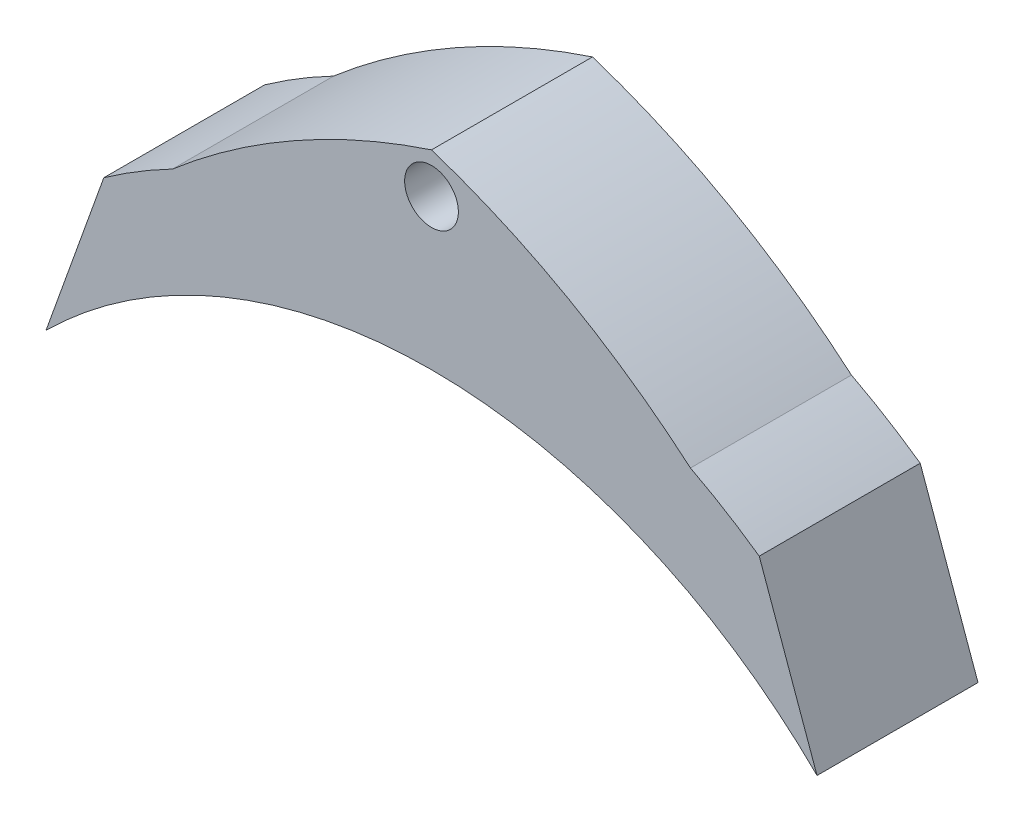
ISO-10303-21;
HEADER;
FILE_DESCRIPTION(('STEP AP214'),'2;1');
FILE_NAME('part.step','',(''),(''),'','','');
FILE_SCHEMA(('AUTOMOTIVE_DESIGN { 1 0 10303 214 1 1 1 1 }'));
ENDSEC;
DATA;
#1=APPLICATION_CONTEXT('core data for automotive mechanical design processes');
#2=APPLICATION_PROTOCOL_DEFINITION('international standard','automotive_design',2000,#1);
#3=PRODUCT_CONTEXT('',#1,'mechanical');
#4=PRODUCT('Part','Part','',(#3));
#5=PRODUCT_RELATED_PRODUCT_CATEGORY('part','',(#4));
#6=PRODUCT_DEFINITION_FORMATION('','',#4);
#7=PRODUCT_DEFINITION_CONTEXT('part definition',#1,'design');
#8=PRODUCT_DEFINITION('design','',#6,#7);
#9=PRODUCT_DEFINITION_SHAPE('','',#8);
#10=(LENGTH_UNIT() NAMED_UNIT(*) SI_UNIT(.MILLI.,.METRE.));
#11=(NAMED_UNIT(*) PLANE_ANGLE_UNIT() SI_UNIT($,.RADIAN.));
#12=(NAMED_UNIT(*) SI_UNIT($,.STERADIAN.) SOLID_ANGLE_UNIT());
#13=UNCERTAINTY_MEASURE_WITH_UNIT(LENGTH_MEASURE(1.E-05),#10,'distance_accuracy_value','');
#14=(GEOMETRIC_REPRESENTATION_CONTEXT(3) GLOBAL_UNCERTAINTY_ASSIGNED_CONTEXT((#13)) GLOBAL_UNIT_ASSIGNED_CONTEXT((#10,
#11,#12)) REPRESENTATION_CONTEXT('',''));
#15=CARTESIAN_POINT('',(0.,0.,0.));
#16=DIRECTION('',(0.,0.,1.));
#17=DIRECTION('',(1.,0.,0.));
#18=AXIS2_PLACEMENT_3D('',#15,#16,#17);
#19=CARTESIAN_POINT('',(0.,0.178177007567934,30.));
#20=DIRECTION('',(0.,0.,-1.));
#21=DIRECTION('',(-1.,0.,0.));
#22=AXIS2_PLACEMENT_3D('',#19,#20,#21);
#23=CYLINDRICAL_SURFACE('',#22,102.051696281294);
#24=CARTESIAN_POINT('',(0.,0.178177007567934,23.32));
#25=DIRECTION('',(0.,0.,1.));
#26=DIRECTION('',(1.,0.,0.));
#27=AXIS2_PLACEMENT_3D('',#24,#25,#26);
#28=CIRCLE('',#27,102.051696281294);
#29=CARTESIAN_POINT('',(-4.15897390437786,102.145091494338,23.32));
#30=VERTEX_POINT('',#29);
#31=CARTESIAN_POINT('',(4.15897390437786,102.145091494338,23.32));
#32=VERTEX_POINT('',#31);
#33=EDGE_CURVE('E12',#30,#32,#28,.F.);
#34=ORIENTED_EDGE('',*,*,#33,.T.);
#35=DIRECTION('',(0.,0.,-1.));
#36=VECTOR('',#35,1.);
#37=CARTESIAN_POINT('',(4.15897390437786,102.145091494338,30.));
#38=LINE('',#37,#36);
#39=CARTESIAN_POINT('',(4.15897390437786,102.145091494338,6.68));
#40=VERTEX_POINT('',#39);
#41=EDGE_CURVE('E352',#32,#40,#38,.T.);
#42=ORIENTED_EDGE('',*,*,#41,.T.);
#43=CARTESIAN_POINT('',(0.,0.178177007567934,6.68));
#44=DIRECTION('',(0.,0.,1.));
#45=DIRECTION('',(1.,0.,0.));
#46=AXIS2_PLACEMENT_3D('',#43,#44,#45);
#47=CIRCLE('',#46,102.051696281294);
#48=CARTESIAN_POINT('',(-4.15897390437786,102.145091494338,6.68));
#49=VERTEX_POINT('',#48);
#50=EDGE_CURVE('E454',#49,#40,#47,.F.);
#51=ORIENTED_EDGE('',*,*,#50,.F.);
#52=DIRECTION('',(0.,0.,-1.));
#53=VECTOR('',#52,1.);
#54=CARTESIAN_POINT('',(-4.15897390437786,102.145091494338,30.));
#55=LINE('',#54,#53);
#56=EDGE_CURVE('E71',#30,#49,#55,.T.);
#57=ORIENTED_EDGE('',*,*,#56,.F.);
#58=EDGE_LOOP('',(#34,#42,#51,#57));
#59=FACE_BOUND('',#58,.T.);
#60=CARTESIAN_POINT('',(0.,0.178177007567934,23.32));
#61=DIRECTION('',(0.,0.,-1.));
#62=DIRECTION('',(-1.,0.,0.));
#63=AXIS2_PLACEMENT_3D('',#60,#61,#62);
#64=CIRCLE('',#63,102.051696281294);
#65=CARTESIAN_POINT('',(-12.258701702562,101.49092520076,23.32));
#66=VERTEX_POINT('',#65);
#67=CARTESIAN_POINT('',(-20.578701702562,100.133495776138,23.32));
#68=VERTEX_POINT('',#67);
#69=EDGE_CURVE('E445',#66,#68,#64,.F.);
#70=ORIENTED_EDGE('',*,*,#69,.F.);
#71=DIRECTION('',(0.,0.,-1.));
#72=VECTOR('',#71,1.);
#73=CARTESIAN_POINT('',(-12.258701702562,101.49092520076,30.));
#74=LINE('',#73,#72);
#75=CARTESIAN_POINT('',(-12.258701702562,101.49092520076,6.68));
#76=VERTEX_POINT('',#75);
#77=EDGE_CURVE('E443',#76,#66,#74,.F.);
#78=ORIENTED_EDGE('',*,*,#77,.F.);
#79=CARTESIAN_POINT('',(0.,0.178177007567934,6.68));
#80=DIRECTION('',(0.,0.,-1.));
#81=DIRECTION('',(-1.,0.,0.));
#82=AXIS2_PLACEMENT_3D('',#79,#80,#81);
#83=CIRCLE('',#82,102.051696281294);
#84=CARTESIAN_POINT('',(-20.578701702562,100.133495776138,6.68));
#85=VERTEX_POINT('',#84);
#86=EDGE_CURVE('E419',#76,#85,#83,.F.);
#87=ORIENTED_EDGE('',*,*,#86,.T.);
#88=DIRECTION('',(0.,0.,-1.));
#89=VECTOR('',#88,1.);
#90=CARTESIAN_POINT('',(-20.578701702562,100.133495776138,30.));
#91=LINE('',#90,#89);
#92=EDGE_CURVE('E440',#68,#85,#91,.T.);
#93=ORIENTED_EDGE('',*,*,#92,.F.);
#94=EDGE_LOOP('',(#70,#78,#87,#93));
#95=FACE_BOUND('',#94,.T.);
#96=DIRECTION('',(0.,0.,-1.));
#97=VECTOR('',#96,1.);
#98=CARTESIAN_POINT('',(71.8430491689302,72.6566220791905,30.));
#99=LINE('',#98,#97);
#100=CARTESIAN_POINT('',(71.8430491689302,72.6566220791905,30.));
#101=VERTEX_POINT('',#100);
#102=CARTESIAN_POINT('',(71.8430491689302,72.6566220791905,0.));
#103=VERTEX_POINT('',#102);
#104=EDGE_CURVE('E315',#101,#103,#99,.T.);
#105=ORIENTED_EDGE('',*,*,#104,.F.);
#106=CARTESIAN_POINT('',(0.,0.178177007567934,30.));
#107=DIRECTION('',(0.,0.,-1.));
#108=DIRECTION('',(-1.,0.,0.));
#109=AXIS2_PLACEMENT_3D('',#106,#107,#108);
#110=CIRCLE('',#109,102.051696281294);
#111=CARTESIAN_POINT('',(-71.8430491689302,72.6566220791905,30.));
#112=VERTEX_POINT('',#111);
#113=EDGE_CURVE('E427',#112,#101,#110,.T.);
#114=ORIENTED_EDGE('',*,*,#113,.F.);
#115=DIRECTION('',(0.,0.,-1.));
#116=VECTOR('',#115,1.);
#117=CARTESIAN_POINT('',(-71.8430491689302,72.6566220791905,30.));
#118=LINE('',#117,#116);
#119=CARTESIAN_POINT('',(-71.8430491689302,72.6566220791905,0.));
#120=VERTEX_POINT('',#119);
#121=EDGE_CURVE('E415',#112,#120,#118,.T.);
#122=ORIENTED_EDGE('',*,*,#121,.T.);
#123=CARTESIAN_POINT('',(0.,0.178177007567934,0.));
#124=DIRECTION('',(0.,0.,-1.));
#125=DIRECTION('',(-1.,0.,0.));
#126=AXIS2_PLACEMENT_3D('',#123,#124,#125);
#127=CIRCLE('',#126,102.051696281294);
#128=EDGE_CURVE('E424',#120,#103,#127,.T.);
#129=ORIENTED_EDGE('',*,*,#128,.T.);
#130=EDGE_LOOP('',(#105,#114,#122,#129));
#131=FACE_BOUND('',#130,.T.);
#132=CARTESIAN_POINT('',(0.,0.178177007567934,23.32));
#133=DIRECTION('',(0.,0.,-1.));
#134=DIRECTION('',(-1.,0.,0.));
#135=AXIS2_PLACEMENT_3D('',#132,#133,#134);
#136=CIRCLE('',#135,102.051696281294);
#137=CARTESIAN_POINT('',(-20.7632804662321,100.095317169655,23.32));
#138=VERTEX_POINT('',#137);
#139=CARTESIAN_POINT('',(-29.0832804662322,97.9979680072016,23.32));
#140=VERTEX_POINT('',#139);
#141=EDGE_CURVE('E452',#138,#140,#136,.F.);
#142=ORIENTED_EDGE('',*,*,#141,.F.);
#143=DIRECTION('',(0.,0.,-1.));
#144=VECTOR('',#143,1.);
#145=CARTESIAN_POINT('',(-20.7632804662321,100.095317169655,30.));
#146=LINE('',#145,#144);
#147=CARTESIAN_POINT('',(-20.7632804662321,100.095317169655,6.68));
#148=VERTEX_POINT('',#147);
#149=EDGE_CURVE('E450',#148,#138,#146,.F.);
#150=ORIENTED_EDGE('',*,*,#149,.F.);
#151=CARTESIAN_POINT('',(0.,0.178177007567934,6.68));
#152=DIRECTION('',(0.,0.,-1.));
#153=DIRECTION('',(-1.,0.,0.));
#154=AXIS2_PLACEMENT_3D('',#151,#152,#153);
#155=CIRCLE('',#154,102.051696281294);
#156=CARTESIAN_POINT('',(-29.0832804662322,97.9979680072016,6.68));
#157=VERTEX_POINT('',#156);
#158=EDGE_CURVE('E447',#148,#157,#155,.F.);
#159=ORIENTED_EDGE('',*,*,#158,.T.);
#160=DIRECTION('',(0.,0.,-1.));
#161=VECTOR('',#160,1.);
#162=CARTESIAN_POINT('',(-29.0832804662322,97.9979680072016,23.32));
#163=LINE('',#162,#161);
#164=EDGE_CURVE('E369',#140,#157,#163,.T.);
#165=ORIENTED_EDGE('',*,*,#164,.F.);
#166=EDGE_LOOP('',(#142,#150,#159,#165));
#167=FACE_BOUND('',#166,.T.);
#168=CARTESIAN_POINT('',(0.,0.178177007567934,23.32));
#169=DIRECTION('',(0.,0.,1.));
#170=DIRECTION('',(1.,0.,0.));
#171=AXIS2_PLACEMENT_3D('',#168,#169,#170);
#172=CIRCLE('',#171,102.051696281294);
#173=CARTESIAN_POINT('',(12.258701702562,101.49092520076,23.32));
#174=VERTEX_POINT('',#173);
#175=CARTESIAN_POINT('',(20.578701702562,100.133495776138,23.32));
#176=VERTEX_POINT('',#175);
#177=EDGE_CURVE('E343',#174,#176,#172,.F.);
#178=ORIENTED_EDGE('',*,*,#177,.T.);
#179=DIRECTION('',(0.,0.,-1.));
#180=VECTOR('',#179,1.);
#181=CARTESIAN_POINT('',(20.578701702562,100.133495776138,30.));
#182=LINE('',#181,#180);
#183=CARTESIAN_POINT('',(20.578701702562,100.133495776138,6.68));
#184=VERTEX_POINT('',#183);
#185=EDGE_CURVE('E337',#176,#184,#182,.T.);
#186=ORIENTED_EDGE('',*,*,#185,.T.);
#187=CARTESIAN_POINT('',(0.,0.178177007567934,6.68));
#188=DIRECTION('',(0.,0.,1.));
#189=DIRECTION('',(1.,0.,0.));
#190=AXIS2_PLACEMENT_3D('',#187,#188,#189);
#191=CIRCLE('',#190,102.051696281294);
#192=CARTESIAN_POINT('',(12.258701702562,101.49092520076,6.68));
#193=VERTEX_POINT('',#192);
#194=EDGE_CURVE('E321',#193,#184,#191,.F.);
#195=ORIENTED_EDGE('',*,*,#194,.F.);
#196=DIRECTION('',(0.,0.,-1.));
#197=VECTOR('',#196,1.);
#198=CARTESIAN_POINT('',(12.258701702562,101.49092520076,30.));
#199=LINE('',#198,#197);
#200=EDGE_CURVE('E340',#193,#174,#199,.F.);
#201=ORIENTED_EDGE('',*,*,#200,.T.);
#202=EDGE_LOOP('',(#178,#186,#195,#201));
#203=FACE_BOUND('',#202,.T.);
#204=CARTESIAN_POINT('',(0.,0.178177007567934,23.32));
#205=DIRECTION('',(0.,0.,1.));
#206=DIRECTION('',(1.,0.,0.));
#207=AXIS2_PLACEMENT_3D('',#204,#205,#206);
#208=CIRCLE('',#207,102.051696281294);
#209=CARTESIAN_POINT('',(20.7632804662321,100.095317169655,23.32));
#210=VERTEX_POINT('',#209);
#211=CARTESIAN_POINT('',(29.0832804662322,97.9979680072016,23.32));
#212=VERTEX_POINT('',#211);
#213=EDGE_CURVE('E349',#210,#212,#208,.F.);
#214=ORIENTED_EDGE('',*,*,#213,.T.);
#215=DIRECTION('',(0.,0.,-1.));
#216=VECTOR('',#215,1.);
#217=CARTESIAN_POINT('',(29.0832804662322,97.9979680072016,23.32));
#218=LINE('',#217,#216);
#219=CARTESIAN_POINT('',(29.0832804662322,97.9979680072016,6.68));
#220=VERTEX_POINT('',#219);
#221=EDGE_CURVE('E279',#212,#220,#218,.T.);
#222=ORIENTED_EDGE('',*,*,#221,.T.);
#223=CARTESIAN_POINT('',(0.,0.178177007567934,6.68));
#224=DIRECTION('',(0.,0.,1.));
#225=DIRECTION('',(1.,0.,0.));
#226=AXIS2_PLACEMENT_3D('',#223,#224,#225);
#227=CIRCLE('',#226,102.051696281294);
#228=CARTESIAN_POINT('',(20.7632804662321,100.095317169655,6.68));
#229=VERTEX_POINT('',#228);
#230=EDGE_CURVE('E346',#229,#220,#227,.F.);
#231=ORIENTED_EDGE('',*,*,#230,.F.);
#232=DIRECTION('',(0.,0.,-1.));
#233=VECTOR('',#232,1.);
#234=CARTESIAN_POINT('',(20.7632804662321,100.095317169655,30.));
#235=LINE('',#234,#233);
#236=EDGE_CURVE('E265',#229,#210,#235,.F.);
#237=ORIENTED_EDGE('',*,*,#236,.T.);
#238=EDGE_LOOP('',(#214,#222,#231,#237));
#239=FACE_BOUND('',#238,.T.);
#240=ADVANCED_FACE('F63',(#59,#95,#131,#167,#203,#239),#23,.F.);
#241=CARTESIAN_POINT('',(44.3654744344892,2.66209195961371,30.));
#242=DIRECTION('',(0.,0.,-1.));
#243=DIRECTION('',(-1.,0.,0.));
#244=AXIS2_PLACEMENT_3D('',#241,#242,#243);
#245=CYLINDRICAL_SURFACE('',#244,142.148642826331);
#246=CARTESIAN_POINT('',(44.3654744344892,2.66209195961371,0.));
#247=DIRECTION('',(0.,0.,1.));
#248=DIRECTION('',(1.,0.,0.));
#249=AXIS2_PLACEMENT_3D('',#246,#247,#248);
#250=CIRCLE('',#249,142.148642826331);
#251=CARTESIAN_POINT('',(0.,137.710014326345,0.));
#252=VERTEX_POINT('',#251);
#253=CARTESIAN_POINT('',(-48.2583710800919,110.490937355727,0.));
#254=VERTEX_POINT('',#253);
#255=EDGE_CURVE('E412',#252,#254,#250,.T.);
#256=ORIENTED_EDGE('',*,*,#255,.T.);
#257=DIRECTION('',(0.,0.,-1.));
#258=VECTOR('',#257,1.);
#259=CARTESIAN_POINT('',(-48.2583710800919,110.490937355727,30.));
#260=LINE('',#259,#258);
#261=CARTESIAN_POINT('',(-48.2583710800919,110.490937355727,30.));
#262=VERTEX_POINT('',#261);
#263=EDGE_CURVE('E411',#262,#254,#260,.T.);
#264=ORIENTED_EDGE('',*,*,#263,.F.);
#265=CARTESIAN_POINT('',(44.3654744344892,2.66209195961371,30.));
#266=DIRECTION('',(0.,0.,1.));
#267=DIRECTION('',(1.,0.,0.));
#268=AXIS2_PLACEMENT_3D('',#265,#266,#267);
#269=CIRCLE('',#268,142.148642826331);
#270=CARTESIAN_POINT('',(0.,137.710014326345,30.));
#271=VERTEX_POINT('',#270);
#272=EDGE_CURVE('E404',#271,#262,#269,.T.);
#273=ORIENTED_EDGE('',*,*,#272,.F.);
#274=DIRECTION('',(0.,0.,-1.));
#275=VECTOR('',#274,1.);
#276=CARTESIAN_POINT('',(0.,137.710014326345,30.));
#277=LINE('',#276,#275);
#278=EDGE_CURVE('E318',#271,#252,#277,.T.);
#279=ORIENTED_EDGE('',*,*,#278,.T.);
#280=EDGE_LOOP('',(#256,#264,#273,#279));
#281=FACE_BOUND('',#280,.T.);
#282=ADVANCED_FACE('F484',(#281),#245,.T.);
#283=CARTESIAN_POINT('',(0.,130.189928824796,30.));
#284=DIRECTION('',(0.,0.,-1.));
#285=DIRECTION('',(-1.,0.,0.));
#286=AXIS2_PLACEMENT_3D('',#283,#284,#285);
#287=CYLINDRICAL_SURFACE('',#286,5.00868750214348);
#288=CARTESIAN_POINT('',(0.,130.189928824796,0.));
#289=DIRECTION('',(0.,0.,1.));
#290=DIRECTION('',(1.,0.,0.));
#291=AXIS2_PLACEMENT_3D('',#288,#289,#290);
#292=CIRCLE('',#291,5.00868750214348);
#293=CARTESIAN_POINT('',(5.00868750214348,130.189928824796,0.));
#294=VERTEX_POINT('',#293);
#295=EDGE_CURVE('E408',#294,#294,#292,.T.);
#296=ORIENTED_EDGE('',*,*,#295,.F.);
#297=EDGE_LOOP('',(#296));
#298=FACE_BOUND('',#297,.T.);
#299=CARTESIAN_POINT('',(0.,130.189928824796,30.));
#300=DIRECTION('',(0.,0.,1.));
#301=DIRECTION('',(1.,0.,0.));
#302=AXIS2_PLACEMENT_3D('',#299,#300,#301);
#303=CIRCLE('',#302,5.00868750214348);
#304=CARTESIAN_POINT('',(5.00868750214348,130.189928824796,30.));
#305=VERTEX_POINT('',#304);
#306=EDGE_CURVE('E407',#305,#305,#303,.T.);
#307=ORIENTED_EDGE('',*,*,#306,.T.);
#308=EDGE_LOOP('',(#307));
#309=FACE_BOUND('',#308,.T.);
#310=ADVANCED_FACE('F490',(#298,#309),#287,.F.);
#311=CARTESIAN_POINT('',(0.,0.,30.));
#312=DIRECTION('',(0.,0.,1.));
#313=DIRECTION('',(1.,0.,0.));
#314=AXIS2_PLACEMENT_3D('',#311,#312,#313);
#315=PLANE('',#314);
#316=CARTESIAN_POINT('',(-44.3654744344892,2.66209195961371,30.));
#317=DIRECTION('',(0.,0.,-1.));
#318=DIRECTION('',(-1.,0.,0.));
#319=AXIS2_PLACEMENT_3D('',#316,#317,#318);
#320=CIRCLE('',#319,142.148642826331);
#321=CARTESIAN_POINT('',(48.2583710800919,110.490937355727,30.));
#322=VERTEX_POINT('',#321);
#323=EDGE_CURVE('E308',#271,#322,#320,.T.);
#324=ORIENTED_EDGE('',*,*,#323,.F.);
#325=ORIENTED_EDGE('',*,*,#272,.T.);
#326=CARTESIAN_POINT('',(1.74216780006512,14.066307944812,30.));
#327=DIRECTION('',(0.,0.,-1.));
#328=DIRECTION('',(-1.,0.,0.));
#329=AXIS2_PLACEMENT_3D('',#326,#327,#328);
#330=CIRCLE('',#329,108.617508005562);
#331=CARTESIAN_POINT('',(-61.0726370356036,102.67817700757,30.));
#332=VERTEX_POINT('',#331);
#333=EDGE_CURVE('E423',#332,#262,#330,.T.);
#334=ORIENTED_EDGE('',*,*,#333,.F.);
#335=DIRECTION('',(0.337682653830065,0.941260020027561,0.));
#336=VECTOR('',#335,1.);
#337=CARTESIAN_POINT('',(-71.8430491689302,72.6566220791905,30.));
#338=LINE('',#337,#336);
#339=EDGE_CURVE('E420',#112,#332,#338,.T.);
#340=ORIENTED_EDGE('',*,*,#339,.F.);
#341=ORIENTED_EDGE('',*,*,#113,.T.);
#342=DIRECTION('',(-0.337682653830065,0.941260020027561,0.));
#343=VECTOR('',#342,1.);
#344=CARTESIAN_POINT('',(71.8430491689302,72.6566220791905,30.));
#345=LINE('',#344,#343);
#346=CARTESIAN_POINT('',(61.0726370356036,102.67817700757,30.));
#347=VERTEX_POINT('',#346);
#348=EDGE_CURVE('E322',#101,#347,#345,.T.);
#349=ORIENTED_EDGE('',*,*,#348,.T.);
#350=CARTESIAN_POINT('',(-1.74216780006512,14.066307944812,30.));
#351=DIRECTION('',(0.,0.,1.));
#352=DIRECTION('',(1.,0.,0.));
#353=AXIS2_PLACEMENT_3D('',#350,#351,#352);
#354=CIRCLE('',#353,108.617508005562);
#355=EDGE_CURVE('E325',#347,#322,#354,.T.);
#356=ORIENTED_EDGE('',*,*,#355,.T.);
#357=EDGE_LOOP('',(#324,#325,#334,#340,#341,#349,#356));
#358=FACE_BOUND('',#357,.T.);
#359=ORIENTED_EDGE('',*,*,#306,.F.);
#360=EDGE_LOOP('',(#359));
#361=FACE_BOUND('',#360,.T.);
#362=ADVANCED_FACE('F502',(#358,#361),#315,.T.);
#363=CARTESIAN_POINT('',(0.,0.,0.));
#364=DIRECTION('',(0.,0.,1.));
#365=DIRECTION('',(1.,0.,0.));
#366=AXIS2_PLACEMENT_3D('',#363,#364,#365);
#367=PLANE('',#366);
#368=ORIENTED_EDGE('',*,*,#255,.F.);
#369=CARTESIAN_POINT('',(-44.3654744344892,2.66209195961371,0.));
#370=DIRECTION('',(0.,0.,-1.));
#371=DIRECTION('',(-1.,0.,0.));
#372=AXIS2_PLACEMENT_3D('',#369,#370,#371);
#373=CIRCLE('',#372,142.148642826331);
#374=CARTESIAN_POINT('',(48.2583710800919,110.490937355727,0.));
#375=VERTEX_POINT('',#374);
#376=EDGE_CURVE('E312',#252,#375,#373,.T.);
#377=ORIENTED_EDGE('',*,*,#376,.T.);
#378=CARTESIAN_POINT('',(-1.74216780006512,14.066307944812,0.));
#379=DIRECTION('',(0.,0.,1.));
#380=DIRECTION('',(1.,0.,0.));
#381=AXIS2_PLACEMENT_3D('',#378,#379,#380);
#382=CIRCLE('',#381,108.617508005562);
#383=CARTESIAN_POINT('',(61.0726370356036,102.67817700757,0.));
#384=VERTEX_POINT('',#383);
#385=EDGE_CURVE('E326',#384,#375,#382,.T.);
#386=ORIENTED_EDGE('',*,*,#385,.F.);
#387=DIRECTION('',(-0.337682653830065,0.941260020027561,0.));
#388=VECTOR('',#387,1.);
#389=CARTESIAN_POINT('',(71.8430491689302,72.6566220791905,0.));
#390=LINE('',#389,#388);
#391=EDGE_CURVE('E307',#103,#384,#390,.T.);
#392=ORIENTED_EDGE('',*,*,#391,.F.);
#393=ORIENTED_EDGE('',*,*,#128,.F.);
#394=DIRECTION('',(0.337682653830065,0.941260020027561,0.));
#395=VECTOR('',#394,1.);
#396=CARTESIAN_POINT('',(-71.8430491689302,72.6566220791905,0.));
#397=LINE('',#396,#395);
#398=CARTESIAN_POINT('',(-61.0726370356036,102.67817700757,0.));
#399=VERTEX_POINT('',#398);
#400=EDGE_CURVE('E403',#120,#399,#397,.T.);
#401=ORIENTED_EDGE('',*,*,#400,.T.);
#402=CARTESIAN_POINT('',(1.74216780006512,14.066307944812,0.));
#403=DIRECTION('',(0.,0.,-1.));
#404=DIRECTION('',(-1.,0.,0.));
#405=AXIS2_PLACEMENT_3D('',#402,#403,#404);
#406=CIRCLE('',#405,108.617508005562);
#407=EDGE_CURVE('E432',#399,#254,#406,.T.);
#408=ORIENTED_EDGE('',*,*,#407,.T.);
#409=EDGE_LOOP('',(#368,#377,#386,#392,#393,#401,#408));
#410=FACE_BOUND('',#409,.T.);
#411=ORIENTED_EDGE('',*,*,#295,.T.);
#412=EDGE_LOOP('',(#411));
#413=FACE_BOUND('',#412,.T.);
#414=ADVANCED_FACE('F494',(#410,#413),#367,.F.);
#415=CARTESIAN_POINT('',(1.74216780006512,14.066307944812,30.));
#416=DIRECTION('',(0.,0.,-1.));
#417=DIRECTION('',(-1.,0.,0.));
#418=AXIS2_PLACEMENT_3D('',#415,#416,#417);
#419=CYLINDRICAL_SURFACE('',#418,108.617508005562);
#420=ORIENTED_EDGE('',*,*,#263,.T.);
#421=ORIENTED_EDGE('',*,*,#407,.F.);
#422=DIRECTION('',(0.,0.,-1.));
#423=VECTOR('',#422,1.);
#424=CARTESIAN_POINT('',(-61.0726370356036,102.67817700757,30.));
#425=LINE('',#424,#423);
#426=EDGE_CURVE('E429',#332,#399,#425,.T.);
#427=ORIENTED_EDGE('',*,*,#426,.F.);
#428=ORIENTED_EDGE('',*,*,#333,.T.);
#429=EDGE_LOOP('',(#420,#421,#427,#428));
#430=FACE_BOUND('',#429,.T.);
#431=ADVANCED_FACE('F486',(#430),#419,.T.);
#432=CARTESIAN_POINT('',(-71.8430491689302,72.6566220791905,30.));
#433=DIRECTION('',(-0.941260020027561,0.337682653830065,0.));
#434=DIRECTION('',(-0.337682653830065,-0.941260020027561,0.));
#435=AXIS2_PLACEMENT_3D('',#432,#433,#434);
#436=PLANE('',#435);
#437=ORIENTED_EDGE('',*,*,#400,.F.);
#438=ORIENTED_EDGE('',*,*,#121,.F.);
#439=ORIENTED_EDGE('',*,*,#339,.T.);
#440=ORIENTED_EDGE('',*,*,#426,.T.);
#441=EDGE_LOOP('',(#437,#438,#439,#440));
#442=FACE_BOUND('',#441,.T.);
#443=ADVANCED_FACE('F65',(#442),#436,.T.);
#444=CARTESIAN_POINT('',(-12.258701702562,100.068970145408,23.32));
#445=DIRECTION('',(-1.,0.,0.));
#446=DIRECTION('',(0.,0.,1.));
#447=AXIS2_PLACEMENT_3D('',#444,#445,#446);
#448=PLANE('',#447);
#449=ORIENTED_EDGE('',*,*,#77,.T.);
#450=DIRECTION('',(0.,1.,0.));
#451=VECTOR('',#450,1.);
#452=CARTESIAN_POINT('',(-12.258701702562,100.068970145408,23.32));
#453=LINE('',#452,#451);
#454=CARTESIAN_POINT('',(-12.258701702562,108.568970145408,23.32));
#455=VERTEX_POINT('',#454);
#456=EDGE_CURVE('E391',#66,#455,#453,.T.);
#457=ORIENTED_EDGE('',*,*,#456,.T.);
#458=DIRECTION('',(0.,0.,-1.));
#459=VECTOR('',#458,1.);
#460=CARTESIAN_POINT('',(-12.258701702562,108.568970145408,23.32));
#461=LINE('',#460,#459);
#462=CARTESIAN_POINT('',(-12.258701702562,108.568970145408,6.68));
#463=VERTEX_POINT('',#462);
#464=EDGE_CURVE('E400',#455,#463,#461,.T.);
#465=ORIENTED_EDGE('',*,*,#464,.T.);
#466=DIRECTION('',(0.,1.,0.));
#467=VECTOR('',#466,1.);
#468=CARTESIAN_POINT('',(-12.258701702562,100.068970145408,6.68));
#469=LINE('',#468,#467);
#470=EDGE_CURVE('E376',#76,#463,#469,.T.);
#471=ORIENTED_EDGE('',*,*,#470,.F.);
#472=EDGE_LOOP('',(#449,#457,#465,#471));
#473=FACE_BOUND('',#472,.T.);
#474=ADVANCED_FACE('F500',(#473),#448,.T.);
#475=CARTESIAN_POINT('',(-20.578701702562,100.068970145408,23.32));
#476=DIRECTION('',(1.,0.,0.));
#477=DIRECTION('',(0.,0.,-1.));
#478=AXIS2_PLACEMENT_3D('',#475,#476,#477);
#479=PLANE('',#478);
#480=ORIENTED_EDGE('',*,*,#92,.T.);
#481=DIRECTION('',(0.,-1.,0.));
#482=VECTOR('',#481,1.);
#483=CARTESIAN_POINT('',(-20.578701702562,100.068970145408,6.68));
#484=LINE('',#483,#482);
#485=CARTESIAN_POINT('',(-20.578701702562,108.568970145408,6.68));
#486=VERTEX_POINT('',#485);
#487=EDGE_CURVE('E389',#486,#85,#484,.T.);
#488=ORIENTED_EDGE('',*,*,#487,.F.);
#489=DIRECTION('',(0.,0.,-1.));
#490=VECTOR('',#489,1.);
#491=CARTESIAN_POINT('',(-20.578701702562,108.568970145408,23.32));
#492=LINE('',#491,#490);
#493=CARTESIAN_POINT('',(-20.578701702562,108.568970145408,23.32));
#494=VERTEX_POINT('',#493);
#495=EDGE_CURVE('E398',#494,#486,#492,.T.);
#496=ORIENTED_EDGE('',*,*,#495,.F.);
#497=DIRECTION('',(0.,-1.,0.));
#498=VECTOR('',#497,1.);
#499=CARTESIAN_POINT('',(-20.578701702562,100.068970145408,23.32));
#500=LINE('',#499,#498);
#501=EDGE_CURVE('E395',#494,#68,#500,.T.);
#502=ORIENTED_EDGE('',*,*,#501,.T.);
#503=EDGE_LOOP('',(#480,#488,#496,#502));
#504=FACE_BOUND('',#503,.T.);
#505=ADVANCED_FACE('F544',(#504),#479,.T.);
#506=CARTESIAN_POINT('',(0.,0.,23.32));
#507=DIRECTION('',(0.,0.,-1.));
#508=DIRECTION('',(-1.,0.,0.));
#509=AXIS2_PLACEMENT_3D('',#506,#507,#508);
#510=PLANE('',#509);
#511=ORIENTED_EDGE('',*,*,#69,.T.);
#512=ORIENTED_EDGE('',*,*,#501,.F.);
#513=DIRECTION('',(-1.,0.,0.));
#514=VECTOR('',#513,1.);
#515=CARTESIAN_POINT('',(-20.578701702562,108.568970145408,23.32));
#516=LINE('',#515,#514);
#517=EDGE_CURVE('E393',#455,#494,#516,.T.);
#518=ORIENTED_EDGE('',*,*,#517,.F.);
#519=ORIENTED_EDGE('',*,*,#456,.F.);
#520=EDGE_LOOP('',(#511,#512,#518,#519));
#521=FACE_BOUND('',#520,.T.);
#522=ADVANCED_FACE('F554',(#521),#510,.T.);
#523=CARTESIAN_POINT('',(0.,0.,6.68));
#524=DIRECTION('',(0.,0.,-1.));
#525=DIRECTION('',(-1.,0.,0.));
#526=AXIS2_PLACEMENT_3D('',#523,#524,#525);
#527=PLANE('',#526);
#528=ORIENTED_EDGE('',*,*,#470,.T.);
#529=DIRECTION('',(-1.,0.,0.));
#530=VECTOR('',#529,1.);
#531=CARTESIAN_POINT('',(-20.578701702562,108.568970145408,6.68));
#532=LINE('',#531,#530);
#533=EDGE_CURVE('E386',#463,#486,#532,.T.);
#534=ORIENTED_EDGE('',*,*,#533,.T.);
#535=ORIENTED_EDGE('',*,*,#487,.T.);
#536=ORIENTED_EDGE('',*,*,#86,.F.);
#537=EDGE_LOOP('',(#528,#534,#535,#536));
#538=FACE_BOUND('',#537,.T.);
#539=ADVANCED_FACE('F550',(#538),#527,.F.);
#540=CARTESIAN_POINT('',(-20.578701702562,108.568970145408,23.32));
#541=DIRECTION('',(0.,-1.,0.));
#542=DIRECTION('',(0.,0.,-1.));
#543=AXIS2_PLACEMENT_3D('',#540,#541,#542);
#544=PLANE('',#543);
#545=ORIENTED_EDGE('',*,*,#464,.F.);
#546=ORIENTED_EDGE('',*,*,#517,.T.);
#547=ORIENTED_EDGE('',*,*,#495,.T.);
#548=ORIENTED_EDGE('',*,*,#533,.F.);
#549=EDGE_LOOP('',(#545,#546,#547,#548));
#550=FACE_BOUND('',#549,.T.);
#551=ADVANCED_FACE('F546',(#550),#544,.T.);
#552=CARTESIAN_POINT('',(-20.7632804662321,97.9979680072016,23.32));
#553=DIRECTION('',(-1.,0.,0.));
#554=DIRECTION('',(0.,0.,1.));
#555=AXIS2_PLACEMENT_3D('',#552,#553,#554);
#556=PLANE('',#555);
#557=ORIENTED_EDGE('',*,*,#149,.T.);
#558=DIRECTION('',(0.,1.,0.));
#559=VECTOR('',#558,1.);
#560=CARTESIAN_POINT('',(-20.7632804662321,97.9979680072016,23.32));
#561=LINE('',#560,#559);
#562=CARTESIAN_POINT('',(-20.7632804662321,108.397968007202,23.32));
#563=VERTEX_POINT('',#562);
#564=EDGE_CURVE('E362',#138,#563,#561,.T.);
#565=ORIENTED_EDGE('',*,*,#564,.T.);
#566=DIRECTION('',(0.,0.,-1.));
#567=VECTOR('',#566,1.);
#568=CARTESIAN_POINT('',(-20.7632804662321,108.397968007202,23.32));
#569=LINE('',#568,#567);
#570=CARTESIAN_POINT('',(-20.7632804662321,108.397968007202,6.68));
#571=VERTEX_POINT('',#570);
#572=EDGE_CURVE('E373',#563,#571,#569,.T.);
#573=ORIENTED_EDGE('',*,*,#572,.T.);
#574=DIRECTION('',(0.,1.,0.));
#575=VECTOR('',#574,1.);
#576=CARTESIAN_POINT('',(-20.7632804662321,97.9979680072016,6.68));
#577=LINE('',#576,#575);
#578=EDGE_CURVE('E356',#148,#571,#577,.T.);
#579=ORIENTED_EDGE('',*,*,#578,.F.);
#580=EDGE_LOOP('',(#557,#565,#573,#579));
#581=FACE_BOUND('',#580,.T.);
#582=ADVANCED_FACE('F549',(#581),#556,.T.);
#583=CARTESIAN_POINT('',(0.,0.,23.32));
#584=DIRECTION('',(0.,0.,-1.));
#585=DIRECTION('',(-1.,0.,0.));
#586=AXIS2_PLACEMENT_3D('',#583,#584,#585);
#587=PLANE('',#586);
#588=ORIENTED_EDGE('',*,*,#141,.T.);
#589=DIRECTION('',(0.,-1.,0.));
#590=VECTOR('',#589,1.);
#591=CARTESIAN_POINT('',(-29.0832804662322,97.9979680072016,23.32));
#592=LINE('',#591,#590);
#593=CARTESIAN_POINT('',(-29.0832804662321,108.397968007202,23.32));
#594=VERTEX_POINT('',#593);
#595=EDGE_CURVE('E366',#594,#140,#592,.T.);
#596=ORIENTED_EDGE('',*,*,#595,.F.);
#597=DIRECTION('',(-1.,0.,0.));
#598=VECTOR('',#597,1.);
#599=CARTESIAN_POINT('',(-29.0832804662321,108.397968007202,23.32));
#600=LINE('',#599,#598);
#601=EDGE_CURVE('E364',#563,#594,#600,.T.);
#602=ORIENTED_EDGE('',*,*,#601,.F.);
#603=ORIENTED_EDGE('',*,*,#564,.F.);
#604=EDGE_LOOP('',(#588,#596,#602,#603));
#605=FACE_BOUND('',#604,.T.);
#606=ADVANCED_FACE('F581',(#605),#587,.T.);
#607=CARTESIAN_POINT('',(0.,0.,6.68));
#608=DIRECTION('',(0.,0.,-1.));
#609=DIRECTION('',(-1.,0.,0.));
#610=AXIS2_PLACEMENT_3D('',#607,#608,#609);
#611=PLANE('',#610);
#612=ORIENTED_EDGE('',*,*,#578,.T.);
#613=DIRECTION('',(-1.,0.,0.));
#614=VECTOR('',#613,1.);
#615=CARTESIAN_POINT('',(-29.0832804662321,108.397968007202,6.68));
#616=LINE('',#615,#614);
#617=CARTESIAN_POINT('',(-29.0832804662321,108.397968007202,6.68));
#618=VERTEX_POINT('',#617);
#619=EDGE_CURVE('E358',#571,#618,#616,.T.);
#620=ORIENTED_EDGE('',*,*,#619,.T.);
#621=DIRECTION('',(0.,-1.,0.));
#622=VECTOR('',#621,1.);
#623=CARTESIAN_POINT('',(-29.0832804662322,97.9979680072016,6.68));
#624=LINE('',#623,#622);
#625=EDGE_CURVE('E86',#618,#157,#624,.T.);
#626=ORIENTED_EDGE('',*,*,#625,.T.);
#627=ORIENTED_EDGE('',*,*,#158,.F.);
#628=EDGE_LOOP('',(#612,#620,#626,#627));
#629=FACE_BOUND('',#628,.T.);
#630=ADVANCED_FACE('F577',(#629),#611,.F.);
#631=CARTESIAN_POINT('',(-29.0832804662321,108.397968007202,23.32));
#632=DIRECTION('',(0.,-1.,0.));
#633=DIRECTION('',(0.,0.,-1.));
#634=AXIS2_PLACEMENT_3D('',#631,#632,#633);
#635=PLANE('',#634);
#636=ORIENTED_EDGE('',*,*,#572,.F.);
#637=ORIENTED_EDGE('',*,*,#601,.T.);
#638=DIRECTION('',(0.,0.,-1.));
#639=VECTOR('',#638,1.);
#640=CARTESIAN_POINT('',(-29.0832804662321,108.397968007202,23.32));
#641=LINE('',#640,#639);
#642=EDGE_CURVE('E371',#594,#618,#641,.T.);
#643=ORIENTED_EDGE('',*,*,#642,.T.);
#644=ORIENTED_EDGE('',*,*,#619,.F.);
#645=EDGE_LOOP('',(#636,#637,#643,#644));
#646=FACE_BOUND('',#645,.T.);
#647=ADVANCED_FACE('F580',(#646),#635,.T.);
#648=CARTESIAN_POINT('',(-29.0832804662322,97.9979680072016,23.32));
#649=DIRECTION('',(1.,0.,0.));
#650=DIRECTION('',(0.,1.,0.));
#651=AXIS2_PLACEMENT_3D('',#648,#649,#650);
#652=PLANE('',#651);
#653=ORIENTED_EDGE('',*,*,#642,.F.);
#654=ORIENTED_EDGE('',*,*,#595,.T.);
#655=ORIENTED_EDGE('',*,*,#164,.T.);
#656=ORIENTED_EDGE('',*,*,#625,.F.);
#657=EDGE_LOOP('',(#653,#654,#655,#656));
#658=FACE_BOUND('',#657,.T.);
#659=ADVANCED_FACE('F481',(#658),#652,.T.);
#660=CARTESIAN_POINT('',(-4.15897390437786,102.130053405941,23.32));
#661=DIRECTION('',(1.,0.,0.));
#662=DIRECTION('',(0.,0.,-1.));
#663=AXIS2_PLACEMENT_3D('',#660,#661,#662);
#664=PLANE('',#663);
#665=ORIENTED_EDGE('',*,*,#56,.T.);
#666=DIRECTION('',(0.,-1.,0.));
#667=VECTOR('',#666,1.);
#668=CARTESIAN_POINT('',(-4.15897390437786,102.130053405941,6.68));
#669=LINE('',#668,#667);
#670=CARTESIAN_POINT('',(-4.15897390437786,110.414797667787,6.68));
#671=VERTEX_POINT('',#670);
#672=EDGE_CURVE('E78',#671,#49,#669,.T.);
#673=ORIENTED_EDGE('',*,*,#672,.F.);
#674=DIRECTION('',(0.,0.,-1.));
#675=VECTOR('',#674,1.);
#676=CARTESIAN_POINT('',(-4.15897390437786,110.414797667787,23.32));
#677=LINE('',#676,#675);
#678=CARTESIAN_POINT('',(-4.15897390437786,110.414797667787,23.32));
#679=VERTEX_POINT('',#678);
#680=EDGE_CURVE('E359',#679,#671,#677,.T.);
#681=ORIENTED_EDGE('',*,*,#680,.F.);
#682=DIRECTION('',(0.,-1.,0.));
#683=VECTOR('',#682,1.);
#684=CARTESIAN_POINT('',(-4.15897390437786,102.130053405941,23.32));
#685=LINE('',#684,#683);
#686=EDGE_CURVE('E381',#679,#30,#685,.T.);
#687=ORIENTED_EDGE('',*,*,#686,.T.);
#688=EDGE_LOOP('',(#665,#673,#681,#687));
#689=FACE_BOUND('',#688,.T.);
#690=ADVANCED_FACE('F458',(#689),#664,.T.);
#691=CARTESIAN_POINT('',(0.,0.,23.32));
#692=DIRECTION('',(0.,0.,1.));
#693=DIRECTION('',(1.,0.,0.));
#694=AXIS2_PLACEMENT_3D('',#691,#692,#693);
#695=PLANE('',#694);
#696=ORIENTED_EDGE('',*,*,#686,.F.);
#697=DIRECTION('',(-1.,0.,0.));
#698=VECTOR('',#697,1.);
#699=CARTESIAN_POINT('',(0.,110.414797667787,23.32));
#700=LINE('',#699,#698);
#701=CARTESIAN_POINT('',(4.15897390437786,110.414797667787,23.32));
#702=VERTEX_POINT('',#701);
#703=EDGE_CURVE('E379',#702,#679,#700,.T.);
#704=ORIENTED_EDGE('',*,*,#703,.F.);
#705=DIRECTION('',(0.,-1.,0.));
#706=VECTOR('',#705,1.);
#707=CARTESIAN_POINT('',(4.15897390437786,102.130053405941,23.32));
#708=LINE('',#707,#706);
#709=EDGE_CURVE('E270',#702,#32,#708,.T.);
#710=ORIENTED_EDGE('',*,*,#709,.T.);
#711=ORIENTED_EDGE('',*,*,#33,.F.);
#712=EDGE_LOOP('',(#696,#704,#710,#711));
#713=FACE_BOUND('',#712,.T.);
#714=ADVANCED_FACE('F473',(#713),#695,.F.);
#715=CARTESIAN_POINT('',(0.,0.,6.68));
#716=DIRECTION('',(0.,0.,1.));
#717=DIRECTION('',(1.,0.,0.));
#718=AXIS2_PLACEMENT_3D('',#715,#716,#717);
#719=PLANE('',#718);
#720=ORIENTED_EDGE('',*,*,#50,.T.);
#721=DIRECTION('',(0.,-1.,0.));
#722=VECTOR('',#721,1.);
#723=CARTESIAN_POINT('',(4.15897390437786,102.130053405941,6.68));
#724=LINE('',#723,#722);
#725=CARTESIAN_POINT('',(4.15897390437786,110.414797667787,6.68));
#726=VERTEX_POINT('',#725);
#727=EDGE_CURVE('E283',#726,#40,#724,.T.);
#728=ORIENTED_EDGE('',*,*,#727,.F.);
#729=DIRECTION('',(-1.,0.,0.));
#730=VECTOR('',#729,1.);
#731=CARTESIAN_POINT('',(0.,110.414797667787,6.68));
#732=LINE('',#731,#730);
#733=EDGE_CURVE('E355',#726,#671,#732,.T.);
#734=ORIENTED_EDGE('',*,*,#733,.T.);
#735=ORIENTED_EDGE('',*,*,#672,.T.);
#736=EDGE_LOOP('',(#720,#728,#734,#735));
#737=FACE_BOUND('',#736,.T.);
#738=ADVANCED_FACE('F465',(#737),#719,.T.);
#739=CARTESIAN_POINT('',(0.,110.414797667787,23.32));
#740=DIRECTION('',(0.,-1.,0.));
#741=DIRECTION('',(0.,0.,-1.));
#742=AXIS2_PLACEMENT_3D('',#739,#740,#741);
#743=PLANE('',#742);
#744=ORIENTED_EDGE('',*,*,#733,.F.);
#745=DIRECTION('',(0.,0.,-1.));
#746=VECTOR('',#745,1.);
#747=CARTESIAN_POINT('',(4.15897390437786,110.414797667787,23.32));
#748=LINE('',#747,#746);
#749=EDGE_CURVE('E267',#702,#726,#748,.T.);
#750=ORIENTED_EDGE('',*,*,#749,.F.);
#751=ORIENTED_EDGE('',*,*,#703,.T.);
#752=ORIENTED_EDGE('',*,*,#680,.T.);
#753=EDGE_LOOP('',(#744,#750,#751,#752));
#754=FACE_BOUND('',#753,.T.);
#755=ADVANCED_FACE('F471',(#754),#743,.T.);
#756=CARTESIAN_POINT('',(-44.3654744344892,2.66209195961371,30.));
#757=DIRECTION('',(0.,0.,-1.));
#758=DIRECTION('',(1.,0.,0.));
#759=AXIS2_PLACEMENT_3D('',#756,#757,#758);
#760=CYLINDRICAL_SURFACE('',#759,142.148642826331);
#761=ORIENTED_EDGE('',*,*,#376,.F.);
#762=ORIENTED_EDGE('',*,*,#278,.F.);
#763=ORIENTED_EDGE('',*,*,#323,.T.);
#764=DIRECTION('',(0.,0.,-1.));
#765=VECTOR('',#764,1.);
#766=CARTESIAN_POINT('',(48.2583710800919,110.490937355727,30.));
#767=LINE('',#766,#765);
#768=EDGE_CURVE('E311',#322,#375,#767,.T.);
#769=ORIENTED_EDGE('',*,*,#768,.T.);
#770=EDGE_LOOP('',(#761,#762,#763,#769));
#771=FACE_BOUND('',#770,.T.);
#772=ADVANCED_FACE('F514',(#771),#760,.T.);
#773=CARTESIAN_POINT('',(-1.74216780006512,14.066307944812,30.));
#774=DIRECTION('',(0.,0.,-1.));
#775=DIRECTION('',(1.,0.,0.));
#776=AXIS2_PLACEMENT_3D('',#773,#774,#775);
#777=CYLINDRICAL_SURFACE('',#776,108.617508005562);
#778=ORIENTED_EDGE('',*,*,#768,.F.);
#779=ORIENTED_EDGE('',*,*,#355,.F.);
#780=DIRECTION('',(0.,0.,-1.));
#781=VECTOR('',#780,1.);
#782=CARTESIAN_POINT('',(61.0726370356036,102.67817700757,30.));
#783=LINE('',#782,#781);
#784=EDGE_CURVE('E328',#347,#384,#783,.T.);
#785=ORIENTED_EDGE('',*,*,#784,.T.);
#786=ORIENTED_EDGE('',*,*,#385,.T.);
#787=EDGE_LOOP('',(#778,#779,#785,#786));
#788=FACE_BOUND('',#787,.T.);
#789=ADVANCED_FACE('F519',(#788),#777,.T.);
#790=CARTESIAN_POINT('',(71.8430491689302,72.6566220791905,30.));
#791=DIRECTION('',(0.941260020027561,0.337682653830065,0.));
#792=DIRECTION('',(0.337682653830065,-0.941260020027561,0.));
#793=AXIS2_PLACEMENT_3D('',#790,#791,#792);
#794=PLANE('',#793);
#795=ORIENTED_EDGE('',*,*,#391,.T.);
#796=ORIENTED_EDGE('',*,*,#784,.F.);
#797=ORIENTED_EDGE('',*,*,#348,.F.);
#798=ORIENTED_EDGE('',*,*,#104,.T.);
#799=EDGE_LOOP('',(#795,#796,#797,#798));
#800=FACE_BOUND('',#799,.T.);
#801=ADVANCED_FACE('F523',(#800),#794,.T.);
#802=CARTESIAN_POINT('',(12.258701702562,100.068970145408,23.32));
#803=DIRECTION('',(1.,0.,0.));
#804=DIRECTION('',(0.,0.,1.));
#805=AXIS2_PLACEMENT_3D('',#802,#803,#804);
#806=PLANE('',#805);
#807=ORIENTED_EDGE('',*,*,#200,.F.);
#808=DIRECTION('',(0.,1.,0.));
#809=VECTOR('',#808,1.);
#810=CARTESIAN_POINT('',(12.258701702562,100.068970145408,6.68));
#811=LINE('',#810,#809);
#812=CARTESIAN_POINT('',(12.258701702562,108.568970145408,6.68));
#813=VERTEX_POINT('',#812);
#814=EDGE_CURVE('E260',#193,#813,#811,.T.);
#815=ORIENTED_EDGE('',*,*,#814,.T.);
#816=DIRECTION('',(0.,0.,-1.));
#817=VECTOR('',#816,1.);
#818=CARTESIAN_POINT('',(12.258701702562,108.568970145408,23.32));
#819=LINE('',#818,#817);
#820=CARTESIAN_POINT('',(12.258701702562,108.568970145408,23.32));
#821=VERTEX_POINT('',#820);
#822=EDGE_CURVE('E304',#821,#813,#819,.T.);
#823=ORIENTED_EDGE('',*,*,#822,.F.);
#824=DIRECTION('',(0.,1.,0.));
#825=VECTOR('',#824,1.);
#826=CARTESIAN_POINT('',(12.258701702562,100.068970145408,23.32));
#827=LINE('',#826,#825);
#828=EDGE_CURVE('E294',#174,#821,#827,.T.);
#829=ORIENTED_EDGE('',*,*,#828,.F.);
#830=EDGE_LOOP('',(#807,#815,#823,#829));
#831=FACE_BOUND('',#830,.T.);
#832=ADVANCED_FACE('F572',(#831),#806,.T.);
#833=CARTESIAN_POINT('',(20.578701702562,100.068970145408,23.32));
#834=DIRECTION('',(-1.,0.,0.));
#835=DIRECTION('',(0.,0.,-1.));
#836=AXIS2_PLACEMENT_3D('',#833,#834,#835);
#837=PLANE('',#836);
#838=ORIENTED_EDGE('',*,*,#185,.F.);
#839=DIRECTION('',(0.,-1.,0.));
#840=VECTOR('',#839,1.);
#841=CARTESIAN_POINT('',(20.578701702562,100.068970145408,23.32));
#842=LINE('',#841,#840);
#843=CARTESIAN_POINT('',(20.578701702562,108.568970145408,23.32));
#844=VERTEX_POINT('',#843);
#845=EDGE_CURVE('E299',#844,#176,#842,.T.);
#846=ORIENTED_EDGE('',*,*,#845,.F.);
#847=DIRECTION('',(0.,0.,-1.));
#848=VECTOR('',#847,1.);
#849=CARTESIAN_POINT('',(20.578701702562,108.568970145408,23.32));
#850=LINE('',#849,#848);
#851=CARTESIAN_POINT('',(20.578701702562,108.568970145408,6.68));
#852=VERTEX_POINT('',#851);
#853=EDGE_CURVE('E301',#844,#852,#850,.T.);
#854=ORIENTED_EDGE('',*,*,#853,.T.);
#855=DIRECTION('',(0.,-1.,0.));
#856=VECTOR('',#855,1.);
#857=CARTESIAN_POINT('',(20.578701702562,100.068970145408,6.68));
#858=LINE('',#857,#856);
#859=EDGE_CURVE('E292',#852,#184,#858,.T.);
#860=ORIENTED_EDGE('',*,*,#859,.T.);
#861=EDGE_LOOP('',(#838,#846,#854,#860));
#862=FACE_BOUND('',#861,.T.);
#863=ADVANCED_FACE('F636',(#862),#837,.T.);
#864=CARTESIAN_POINT('',(0.,0.,23.32));
#865=DIRECTION('',(0.,0.,-1.));
#866=DIRECTION('',(1.,0.,0.));
#867=AXIS2_PLACEMENT_3D('',#864,#865,#866);
#868=PLANE('',#867);
#869=ORIENTED_EDGE('',*,*,#177,.F.);
#870=ORIENTED_EDGE('',*,*,#828,.T.);
#871=DIRECTION('',(1.,0.,0.));
#872=VECTOR('',#871,1.);
#873=CARTESIAN_POINT('',(20.578701702562,108.568970145408,23.32));
#874=LINE('',#873,#872);
#875=EDGE_CURVE('E297',#821,#844,#874,.T.);
#876=ORIENTED_EDGE('',*,*,#875,.T.);
#877=ORIENTED_EDGE('',*,*,#845,.T.);
#878=EDGE_LOOP('',(#869,#870,#876,#877));
#879=FACE_BOUND('',#878,.T.);
#880=ADVANCED_FACE('F632',(#879),#868,.T.);
#881=CARTESIAN_POINT('',(0.,0.,6.68));
#882=DIRECTION('',(0.,0.,-1.));
#883=DIRECTION('',(1.,0.,0.));
#884=AXIS2_PLACEMENT_3D('',#881,#882,#883);
#885=PLANE('',#884);
#886=ORIENTED_EDGE('',*,*,#814,.F.);
#887=ORIENTED_EDGE('',*,*,#194,.T.);
#888=ORIENTED_EDGE('',*,*,#859,.F.);
#889=DIRECTION('',(1.,0.,0.));
#890=VECTOR('',#889,1.);
#891=CARTESIAN_POINT('',(20.578701702562,108.568970145408,6.68));
#892=LINE('',#891,#890);
#893=EDGE_CURVE('E290',#813,#852,#892,.T.);
#894=ORIENTED_EDGE('',*,*,#893,.F.);
#895=EDGE_LOOP('',(#886,#887,#888,#894));
#896=FACE_BOUND('',#895,.T.);
#897=ADVANCED_FACE('F629',(#896),#885,.F.);
#898=CARTESIAN_POINT('',(20.578701702562,108.568970145408,23.32));
#899=DIRECTION('',(0.,-1.,0.));
#900=DIRECTION('',(0.,0.,-1.));
#901=AXIS2_PLACEMENT_3D('',#898,#899,#900);
#902=PLANE('',#901);
#903=ORIENTED_EDGE('',*,*,#822,.T.);
#904=ORIENTED_EDGE('',*,*,#893,.T.);
#905=ORIENTED_EDGE('',*,*,#853,.F.);
#906=ORIENTED_EDGE('',*,*,#875,.F.);
#907=EDGE_LOOP('',(#903,#904,#905,#906));
#908=FACE_BOUND('',#907,.T.);
#909=ADVANCED_FACE('F627',(#908),#902,.T.);
#910=CARTESIAN_POINT('',(20.7632804662321,97.9979680072016,23.32));
#911=DIRECTION('',(1.,0.,0.));
#912=DIRECTION('',(0.,0.,1.));
#913=AXIS2_PLACEMENT_3D('',#910,#911,#912);
#914=PLANE('',#913);
#915=ORIENTED_EDGE('',*,*,#236,.F.);
#916=DIRECTION('',(0.,1.,0.));
#917=VECTOR('',#916,1.);
#918=CARTESIAN_POINT('',(20.7632804662321,97.9979680072016,6.68));
#919=LINE('',#918,#917);
#920=CARTESIAN_POINT('',(20.7632804662321,108.397968007202,6.68));
#921=VERTEX_POINT('',#920);
#922=EDGE_CURVE('E248',#229,#921,#919,.T.);
#923=ORIENTED_EDGE('',*,*,#922,.T.);
#924=DIRECTION('',(0.,0.,-1.));
#925=VECTOR('',#924,1.);
#926=CARTESIAN_POINT('',(20.7632804662321,108.397968007202,23.32));
#927=LINE('',#926,#925);
#928=CARTESIAN_POINT('',(20.7632804662321,108.397968007202,23.32));
#929=VERTEX_POINT('',#928);
#930=EDGE_CURVE('E254',#929,#921,#927,.T.);
#931=ORIENTED_EDGE('',*,*,#930,.F.);
#932=DIRECTION('',(0.,1.,0.));
#933=VECTOR('',#932,1.);
#934=CARTESIAN_POINT('',(20.7632804662321,97.9979680072016,23.32));
#935=LINE('',#934,#933);
#936=EDGE_CURVE('E274',#210,#929,#935,.T.);
#937=ORIENTED_EDGE('',*,*,#936,.F.);
#938=EDGE_LOOP('',(#915,#923,#931,#937));
#939=FACE_BOUND('',#938,.T.);
#940=ADVANCED_FACE('F263',(#939),#914,.T.);
#941=CARTESIAN_POINT('',(0.,0.,23.32));
#942=DIRECTION('',(0.,0.,-1.));
#943=DIRECTION('',(1.,0.,0.));
#944=AXIS2_PLACEMENT_3D('',#941,#942,#943);
#945=PLANE('',#944);
#946=ORIENTED_EDGE('',*,*,#213,.F.);
#947=ORIENTED_EDGE('',*,*,#936,.T.);
#948=DIRECTION('',(1.,0.,0.));
#949=VECTOR('',#948,1.);
#950=CARTESIAN_POINT('',(29.0832804662321,108.397968007202,23.32));
#951=LINE('',#950,#949);
#952=CARTESIAN_POINT('',(29.0832804662321,108.397968007202,23.32));
#953=VERTEX_POINT('',#952);
#954=EDGE_CURVE('E257',#929,#953,#951,.T.);
#955=ORIENTED_EDGE('',*,*,#954,.T.);
#956=DIRECTION('',(0.,-1.,0.));
#957=VECTOR('',#956,1.);
#958=CARTESIAN_POINT('',(29.0832804662322,97.9979680072016,23.32));
#959=LINE('',#958,#957);
#960=EDGE_CURVE('E277',#953,#212,#959,.T.);
#961=ORIENTED_EDGE('',*,*,#960,.T.);
#962=EDGE_LOOP('',(#946,#947,#955,#961));
#963=FACE_BOUND('',#962,.T.);
#964=ADVANCED_FACE('F611',(#963),#945,.T.);
#965=CARTESIAN_POINT('',(0.,0.,6.68));
#966=DIRECTION('',(0.,0.,-1.));
#967=DIRECTION('',(1.,0.,0.));
#968=AXIS2_PLACEMENT_3D('',#965,#966,#967);
#969=PLANE('',#968);
#970=ORIENTED_EDGE('',*,*,#922,.F.);
#971=ORIENTED_EDGE('',*,*,#230,.T.);
#972=DIRECTION('',(0.,-1.,0.));
#973=VECTOR('',#972,1.);
#974=CARTESIAN_POINT('',(29.0832804662322,97.9979680072016,6.68));
#975=LINE('',#974,#973);
#976=CARTESIAN_POINT('',(29.0832804662321,108.397968007202,6.68));
#977=VERTEX_POINT('',#976);
#978=EDGE_CURVE('E250',#977,#220,#975,.T.);
#979=ORIENTED_EDGE('',*,*,#978,.F.);
#980=DIRECTION('',(1.,0.,0.));
#981=VECTOR('',#980,1.);
#982=CARTESIAN_POINT('',(29.0832804662321,108.397968007202,6.68));
#983=LINE('',#982,#981);
#984=EDGE_CURVE('E243',#921,#977,#983,.T.);
#985=ORIENTED_EDGE('',*,*,#984,.F.);
#986=EDGE_LOOP('',(#970,#971,#979,#985));
#987=FACE_BOUND('',#986,.T.);
#988=ADVANCED_FACE('F245',(#987),#969,.F.);
#989=CARTESIAN_POINT('',(29.0832804662321,108.397968007202,23.32));
#990=DIRECTION('',(0.,-1.,0.));
#991=DIRECTION('',(0.,0.,-1.));
#992=AXIS2_PLACEMENT_3D('',#989,#990,#991);
#993=PLANE('',#992);
#994=ORIENTED_EDGE('',*,*,#930,.T.);
#995=ORIENTED_EDGE('',*,*,#984,.T.);
#996=DIRECTION('',(0.,0.,-1.));
#997=VECTOR('',#996,1.);
#998=CARTESIAN_POINT('',(29.0832804662321,108.397968007202,23.32));
#999=LINE('',#998,#997);
#1000=EDGE_CURVE('E261',#953,#977,#999,.T.);
#1001=ORIENTED_EDGE('',*,*,#1000,.F.);
#1002=ORIENTED_EDGE('',*,*,#954,.F.);
#1003=EDGE_LOOP('',(#994,#995,#1001,#1002));
#1004=FACE_BOUND('',#1003,.T.);
#1005=ADVANCED_FACE('F255',(#1004),#993,.T.);
#1006=CARTESIAN_POINT('',(29.0832804662322,97.9979680072016,23.32));
#1007=DIRECTION('',(-1.,0.,0.));
#1008=DIRECTION('',(0.,1.,0.));
#1009=AXIS2_PLACEMENT_3D('',#1006,#1007,#1008);
#1010=PLANE('',#1009);
#1011=ORIENTED_EDGE('',*,*,#1000,.T.);
#1012=ORIENTED_EDGE('',*,*,#978,.T.);
#1013=ORIENTED_EDGE('',*,*,#221,.F.);
#1014=ORIENTED_EDGE('',*,*,#960,.F.);
#1015=EDGE_LOOP('',(#1011,#1012,#1013,#1014));
#1016=FACE_BOUND('',#1015,.T.);
#1017=ADVANCED_FACE('F614',(#1016),#1010,.T.);
#1018=CARTESIAN_POINT('',(4.15897390437786,102.130053405941,23.32));
#1019=DIRECTION('',(-1.,0.,0.));
#1020=DIRECTION('',(0.,0.,-1.));
#1021=AXIS2_PLACEMENT_3D('',#1018,#1019,#1020);
#1022=PLANE('',#1021);
#1023=ORIENTED_EDGE('',*,*,#41,.F.);
#1024=ORIENTED_EDGE('',*,*,#709,.F.);
#1025=ORIENTED_EDGE('',*,*,#749,.T.);
#1026=ORIENTED_EDGE('',*,*,#727,.T.);
#1027=EDGE_LOOP('',(#1023,#1024,#1025,#1026));
#1028=FACE_BOUND('',#1027,.T.);
#1029=ADVANCED_FACE('F467',(#1028),#1022,.T.);
#1030=CLOSED_SHELL('',(#240,#282,#310,#362,#414,#431,#443,#474,#505,#522,#539,#551,#582,#606,
#630,#647,#659,#690,#714,#738,#755,#772,#789,#801,#832,#863,#880,#897,#909,#940,#964,#988,#1005,
#1017,#1029));
#1031=MANIFOLD_SOLID_BREP('B2',#1030);
#1032=ADVANCED_BREP_SHAPE_REPRESENTATION('',(#18,#1031),#14);
#1033=SHAPE_DEFINITION_REPRESENTATION(#9,#1032);
ENDSEC;
END-ISO-10303-21;
